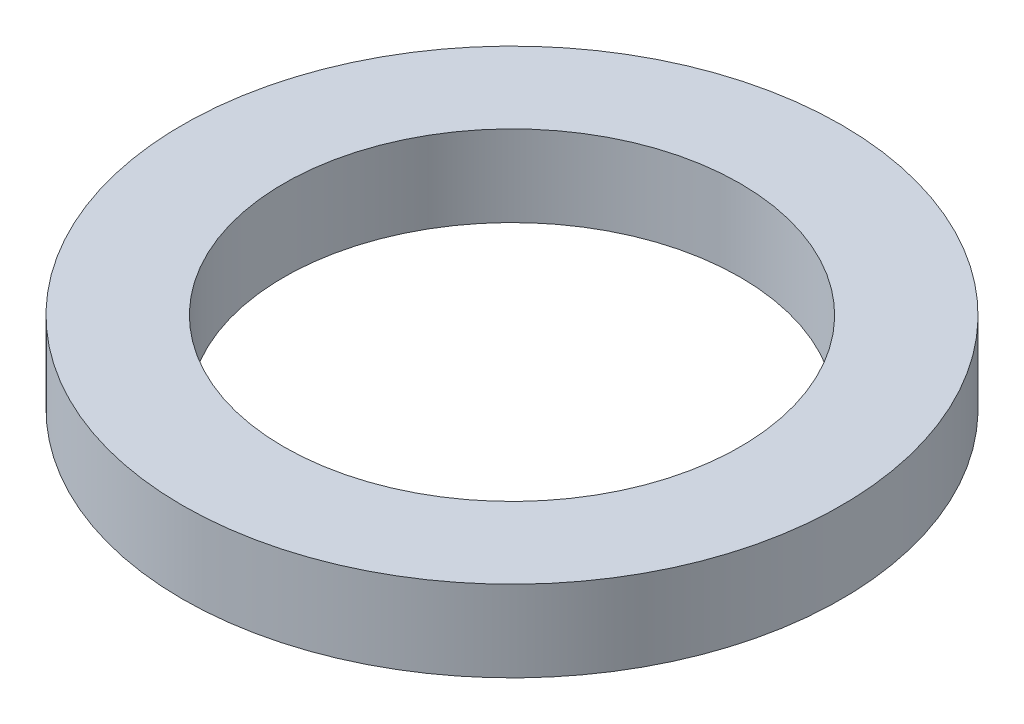
ISO-10303-21;
HEADER;
FILE_DESCRIPTION(('STEP AP214'),'2;1');
FILE_NAME('part.step','',(''),(''),'','','');
FILE_SCHEMA(('AUTOMOTIVE_DESIGN { 1 0 10303 214 1 1 1 1 }'));
ENDSEC;
DATA;
#1=APPLICATION_CONTEXT('core data for automotive mechanical design processes');
#2=APPLICATION_PROTOCOL_DEFINITION('international standard','automotive_design',2000,#1);
#3=PRODUCT_CONTEXT('',#1,'mechanical');
#4=PRODUCT('Part','Part','',(#3));
#5=PRODUCT_RELATED_PRODUCT_CATEGORY('part','',(#4));
#6=PRODUCT_DEFINITION_FORMATION('','',#4);
#7=PRODUCT_DEFINITION_CONTEXT('part definition',#1,'design');
#8=PRODUCT_DEFINITION('design','',#6,#7);
#9=PRODUCT_DEFINITION_SHAPE('','',#8);
#10=(LENGTH_UNIT() NAMED_UNIT(*) SI_UNIT(.MILLI.,.METRE.));
#11=(NAMED_UNIT(*) PLANE_ANGLE_UNIT() SI_UNIT($,.RADIAN.));
#12=(NAMED_UNIT(*) SI_UNIT($,.STERADIAN.) SOLID_ANGLE_UNIT());
#13=UNCERTAINTY_MEASURE_WITH_UNIT(LENGTH_MEASURE(1.E-05),#10,'distance_accuracy_value','');
#14=(GEOMETRIC_REPRESENTATION_CONTEXT(3) GLOBAL_UNCERTAINTY_ASSIGNED_CONTEXT((#13)) GLOBAL_UNIT_ASSIGNED_CONTEXT((#10,
#11,#12)) REPRESENTATION_CONTEXT('',''));
#15=CARTESIAN_POINT('',(0.,0.,0.));
#16=DIRECTION('',(0.,0.,1.));
#17=DIRECTION('',(1.,0.,0.));
#18=AXIS2_PLACEMENT_3D('',#15,#16,#17);
#19=CARTESIAN_POINT('',(0.,8.,0.));
#20=DIRECTION('',(0.,-1.,0.));
#21=DIRECTION('',(0.,0.,-1.));
#22=AXIS2_PLACEMENT_3D('',#19,#20,#21);
#23=CYLINDRICAL_SURFACE('',#22,32.5);
#24=CARTESIAN_POINT('',(0.,8.,0.));
#25=DIRECTION('',(0.,1.,0.));
#26=DIRECTION('',(0.,0.,1.));
#27=AXIS2_PLACEMENT_3D('',#24,#25,#26);
#28=CIRCLE('',#27,32.5);
#29=CARTESIAN_POINT('',(0.,8.,32.5));
#30=VERTEX_POINT('',#29);
#31=EDGE_CURVE('E10',#30,#30,#28,.T.);
#32=ORIENTED_EDGE('',*,*,#31,.F.);
#33=EDGE_LOOP('',(#32));
#34=FACE_BOUND('',#33,.T.);
#35=CARTESIAN_POINT('',(0.,0.,0.));
#36=DIRECTION('',(0.,1.,0.));
#37=DIRECTION('',(0.,0.,1.));
#38=AXIS2_PLACEMENT_3D('',#35,#36,#37);
#39=CIRCLE('',#38,32.5);
#40=CARTESIAN_POINT('',(0.,0.,32.5));
#41=VERTEX_POINT('',#40);
#42=EDGE_CURVE('E37',#41,#41,#39,.T.);
#43=ORIENTED_EDGE('',*,*,#42,.T.);
#44=EDGE_LOOP('',(#43));
#45=FACE_BOUND('',#44,.T.);
#46=ADVANCED_FACE('F40',(#34,#45),#23,.T.);
#47=CARTESIAN_POINT('',(0.,8.,0.));
#48=DIRECTION('',(0.,1.,0.));
#49=DIRECTION('',(0.,0.,1.));
#50=AXIS2_PLACEMENT_3D('',#47,#48,#49);
#51=PLANE('',#50);
#52=CARTESIAN_POINT('',(0.,8.,0.));
#53=DIRECTION('',(0.,1.,0.));
#54=DIRECTION('',(0.,0.,1.));
#55=AXIS2_PLACEMENT_3D('',#52,#53,#54);
#56=CIRCLE('',#55,22.5);
#57=CARTESIAN_POINT('',(0.,8.,22.5));
#58=VERTEX_POINT('',#57);
#59=EDGE_CURVE('E50',#58,#58,#56,.T.);
#60=ORIENTED_EDGE('',*,*,#59,.F.);
#61=EDGE_LOOP('',(#60));
#62=FACE_BOUND('',#61,.T.);
#63=ORIENTED_EDGE('',*,*,#31,.T.);
#64=EDGE_LOOP('',(#63));
#65=FACE_BOUND('',#64,.T.);
#66=ADVANCED_FACE('F59',(#62,#65),#51,.T.);
#67=CARTESIAN_POINT('',(0.,0.,0.));
#68=DIRECTION('',(0.,1.,0.));
#69=DIRECTION('',(0.,0.,1.));
#70=AXIS2_PLACEMENT_3D('',#67,#68,#69);
#71=PLANE('',#70);
#72=CARTESIAN_POINT('',(0.,0.,0.));
#73=DIRECTION('',(0.,1.,0.));
#74=DIRECTION('',(0.,0.,1.));
#75=AXIS2_PLACEMENT_3D('',#72,#73,#74);
#76=CIRCLE('',#75,22.5);
#77=CARTESIAN_POINT('',(0.,0.,22.5));
#78=VERTEX_POINT('',#77);
#79=EDGE_CURVE('E47',#78,#78,#76,.T.);
#80=ORIENTED_EDGE('',*,*,#79,.T.);
#81=EDGE_LOOP('',(#80));
#82=FACE_BOUND('',#81,.T.);
#83=ORIENTED_EDGE('',*,*,#42,.F.);
#84=EDGE_LOOP('',(#83));
#85=FACE_BOUND('',#84,.T.);
#86=ADVANCED_FACE('F58',(#82,#85),#71,.F.);
#87=CARTESIAN_POINT('',(0.,8.,0.));
#88=DIRECTION('',(0.,-1.,0.));
#89=DIRECTION('',(0.,0.,-1.));
#90=AXIS2_PLACEMENT_3D('',#87,#88,#89);
#91=CYLINDRICAL_SURFACE('',#90,22.5);
#92=ORIENTED_EDGE('',*,*,#59,.T.);
#93=EDGE_LOOP('',(#92));
#94=FACE_BOUND('',#93,.T.);
#95=ORIENTED_EDGE('',*,*,#79,.F.);
#96=EDGE_LOOP('',(#95));
#97=FACE_BOUND('',#96,.T.);
#98=ADVANCED_FACE('F54',(#94,#97),#91,.F.);
#99=CLOSED_SHELL('',(#46,#66,#86,#98));
#100=MANIFOLD_SOLID_BREP('B2',#99);
#101=ADVANCED_BREP_SHAPE_REPRESENTATION('',(#18,#100),#14);
#102=SHAPE_DEFINITION_REPRESENTATION(#9,#101);
ENDSEC;
END-ISO-10303-21;
